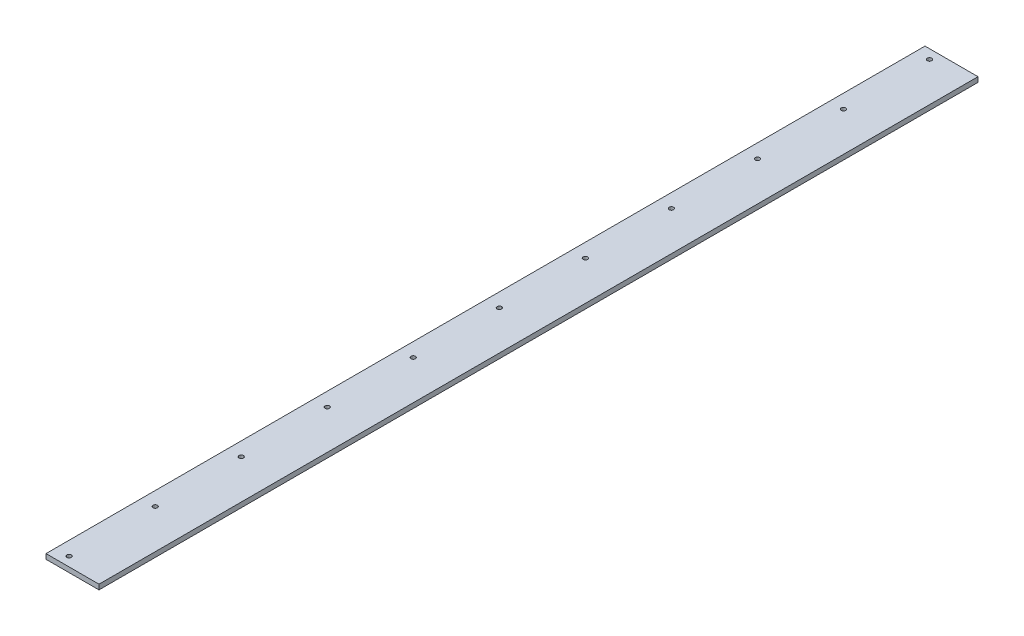
ISO-10303-21;
HEADER;
FILE_DESCRIPTION(('STEP AP214'),'2;1');
FILE_NAME('part.step','',(''),(''),'','','');
FILE_SCHEMA(('AUTOMOTIVE_DESIGN { 1 0 10303 214 1 1 1 1 }'));
ENDSEC;
DATA;
#1=APPLICATION_CONTEXT('core data for automotive mechanical design processes');
#2=APPLICATION_PROTOCOL_DEFINITION('international standard','automotive_design',2000,#1);
#3=PRODUCT_CONTEXT('',#1,'mechanical');
#4=PRODUCT('Part','Part','',(#3));
#5=PRODUCT_RELATED_PRODUCT_CATEGORY('part','',(#4));
#6=PRODUCT_DEFINITION_FORMATION('','',#4);
#7=PRODUCT_DEFINITION_CONTEXT('part definition',#1,'design');
#8=PRODUCT_DEFINITION('design','',#6,#7);
#9=PRODUCT_DEFINITION_SHAPE('','',#8);
#10=(LENGTH_UNIT() NAMED_UNIT(*) SI_UNIT(.MILLI.,.METRE.));
#11=(NAMED_UNIT(*) PLANE_ANGLE_UNIT() SI_UNIT($,.RADIAN.));
#12=(NAMED_UNIT(*) SI_UNIT($,.STERADIAN.) SOLID_ANGLE_UNIT());
#13=UNCERTAINTY_MEASURE_WITH_UNIT(LENGTH_MEASURE(1.E-05),#10,'distance_accuracy_value','');
#14=(GEOMETRIC_REPRESENTATION_CONTEXT(3) GLOBAL_UNCERTAINTY_ASSIGNED_CONTEXT((#13)) GLOBAL_UNIT_ASSIGNED_CONTEXT((#10,
#11,#12)) REPRESENTATION_CONTEXT('',''));
#15=CARTESIAN_POINT('',(0.,0.,0.));
#16=DIRECTION('',(0.,0.,1.));
#17=DIRECTION('',(1.,0.,0.));
#18=AXIS2_PLACEMENT_3D('',#15,#16,#17);
#19=CARTESIAN_POINT('',(-32.1866248836563,0.,795.375640553966));
#20=DIRECTION('',(1.,0.,0.));
#21=DIRECTION('',(0.,0.,-1.));
#22=AXIS2_PLACEMENT_3D('',#19,#20,#21);
#23=PLANE('',#22);
#24=DIRECTION('',(0.,-1.,0.));
#25=VECTOR('',#24,1.);
#26=CARTESIAN_POINT('',(-32.1866248836563,0.,705.));
#27=LINE('',#26,#25);
#28=CARTESIAN_POINT('',(-32.1866248836563,8.,705.));
#29=VERTEX_POINT('',#28);
#30=CARTESIAN_POINT('',(-32.1866248836563,0.,705.));
#31=VERTEX_POINT('',#30);
#32=EDGE_CURVE('E140',#29,#31,#27,.T.);
#33=ORIENTED_EDGE('',*,*,#32,.F.);
#34=DIRECTION('',(0.,0.,-1.));
#35=VECTOR('',#34,1.);
#36=CARTESIAN_POINT('',(-32.1866248836563,8.,795.375640553966));
#37=LINE('',#36,#35);
#38=CARTESIAN_POINT('',(-32.1866248836563,8.,-705.));
#39=VERTEX_POINT('',#38);
#40=EDGE_CURVE('E39',#29,#39,#37,.T.);
#41=ORIENTED_EDGE('',*,*,#40,.T.);
#42=DIRECTION('',(0.,-1.,0.));
#43=VECTOR('',#42,1.);
#44=CARTESIAN_POINT('',(-32.1866248836563,0.,-705.));
#45=LINE('',#44,#43);
#46=CARTESIAN_POINT('',(-32.1866248836563,0.,-705.));
#47=VERTEX_POINT('',#46);
#48=EDGE_CURVE('E94',#39,#47,#45,.T.);
#49=ORIENTED_EDGE('',*,*,#48,.T.);
#50=DIRECTION('',(0.,0.,-1.));
#51=VECTOR('',#50,1.);
#52=CARTESIAN_POINT('',(-32.1866248836563,0.,795.375640553966));
#53=LINE('',#52,#51);
#54=EDGE_CURVE('E82',#31,#47,#53,.T.);
#55=ORIENTED_EDGE('',*,*,#54,.F.);
#56=EDGE_LOOP('',(#33,#41,#49,#55));
#57=FACE_BOUND('',#56,.T.);
#58=ADVANCED_FACE('F35',(#57),#23,.F.);
#59=CARTESIAN_POINT('',(-32.1866248836563,0.,795.375640553966));
#60=DIRECTION('',(0.,1.,0.));
#61=DIRECTION('',(-1.,0.,0.));
#62=AXIS2_PLACEMENT_3D('',#59,#60,#61);
#63=PLANE('',#62);
#64=DIRECTION('',(1.,0.,0.));
#65=VECTOR('',#64,1.);
#66=CARTESIAN_POINT('',(-32.1866248836563,0.,-705.));
#67=LINE('',#66,#65);
#68=CARTESIAN_POINT('',(52.8133751163437,0.,-705.));
#69=VERTEX_POINT('',#68);
#70=EDGE_CURVE('E86',#47,#69,#67,.T.);
#71=ORIENTED_EDGE('',*,*,#70,.T.);
#72=DIRECTION('',(0.,0.,-1.));
#73=VECTOR('',#72,1.);
#74=CARTESIAN_POINT('',(52.8133751163437,0.,795.375640553966));
#75=LINE('',#74,#73);
#76=CARTESIAN_POINT('',(52.8133751163437,0.,705.));
#77=VERTEX_POINT('',#76);
#78=EDGE_CURVE('E88',#77,#69,#75,.T.);
#79=ORIENTED_EDGE('',*,*,#78,.F.);
#80=DIRECTION('',(1.,0.,0.));
#81=VECTOR('',#80,1.);
#82=CARTESIAN_POINT('',(-32.1866248836563,0.,705.));
#83=LINE('',#82,#81);
#84=EDGE_CURVE('E44',#31,#77,#83,.T.);
#85=ORIENTED_EDGE('',*,*,#84,.F.);
#86=ORIENTED_EDGE('',*,*,#54,.T.);
#87=EDGE_LOOP('',(#71,#79,#85,#86));
#88=FACE_BOUND('',#87,.T.);
#89=CARTESIAN_POINT('',(-10.0060966544101,0.,690.));
#90=DIRECTION('',(0.,-1.,0.));
#91=DIRECTION('',(0.,0.,-1.));
#92=AXIS2_PLACEMENT_3D('',#89,#90,#91);
#93=CIRCLE('',#92,3.55);
#94=CARTESIAN_POINT('',(-10.0060966544101,0.,686.45));
#95=VERTEX_POINT('',#94);
#96=EDGE_CURVE('E103',#95,#95,#93,.T.);
#97=ORIENTED_EDGE('',*,*,#96,.F.);
#98=EDGE_LOOP('',(#97));
#99=FACE_BOUND('',#98,.T.);
#100=CARTESIAN_POINT('',(-10.0060966544102,0.,552.));
#101=DIRECTION('',(0.,-1.,0.));
#102=DIRECTION('',(0.,0.,-1.));
#103=AXIS2_PLACEMENT_3D('',#100,#101,#102);
#104=CIRCLE('',#103,3.55);
#105=CARTESIAN_POINT('',(-10.0060966544102,0.,548.45));
#106=VERTEX_POINT('',#105);
#107=EDGE_CURVE('E109',#106,#106,#104,.T.);
#108=ORIENTED_EDGE('',*,*,#107,.F.);
#109=EDGE_LOOP('',(#108));
#110=FACE_BOUND('',#109,.T.);
#111=CARTESIAN_POINT('',(-10.0060966544102,0.,414.));
#112=DIRECTION('',(0.,-1.,0.));
#113=DIRECTION('',(0.,0.,-1.));
#114=AXIS2_PLACEMENT_3D('',#111,#112,#113);
#115=CIRCLE('',#114,3.55);
#116=CARTESIAN_POINT('',(-10.0060966544102,0.,410.45));
#117=VERTEX_POINT('',#116);
#118=EDGE_CURVE('E115',#117,#117,#115,.T.);
#119=ORIENTED_EDGE('',*,*,#118,.F.);
#120=EDGE_LOOP('',(#119));
#121=FACE_BOUND('',#120,.T.);
#122=CARTESIAN_POINT('',(-10.0060966544102,0.,138.));
#123=DIRECTION('',(0.,-1.,0.));
#124=DIRECTION('',(0.,0.,-1.));
#125=AXIS2_PLACEMENT_3D('',#122,#123,#124);
#126=CIRCLE('',#125,3.55);
#127=CARTESIAN_POINT('',(-10.0060966544102,0.,134.45));
#128=VERTEX_POINT('',#127);
#129=EDGE_CURVE('E121',#128,#128,#126,.T.);
#130=ORIENTED_EDGE('',*,*,#129,.F.);
#131=EDGE_LOOP('',(#130));
#132=FACE_BOUND('',#131,.T.);
#133=CARTESIAN_POINT('',(-10.0060966544102,0.,276.));
#134=DIRECTION('',(0.,-1.,0.));
#135=DIRECTION('',(0.,0.,-1.));
#136=AXIS2_PLACEMENT_3D('',#133,#134,#135);
#137=CIRCLE('',#136,3.55);
#138=CARTESIAN_POINT('',(-10.0060966544102,0.,272.45));
#139=VERTEX_POINT('',#138);
#140=EDGE_CURVE('E133',#139,#139,#137,.T.);
#141=ORIENTED_EDGE('',*,*,#140,.F.);
#142=EDGE_LOOP('',(#141));
#143=FACE_BOUND('',#142,.T.);
#144=CARTESIAN_POINT('',(-10.0060966544101,0.,0.));
#145=DIRECTION('',(0.,-1.,0.));
#146=DIRECTION('',(0.,0.,-1.));
#147=AXIS2_PLACEMENT_3D('',#144,#145,#146);
#148=CIRCLE('',#147,3.55);
#149=CARTESIAN_POINT('',(-10.0060966544101,0.,-3.55));
#150=VERTEX_POINT('',#149);
#151=EDGE_CURVE('E127',#150,#150,#148,.T.);
#152=ORIENTED_EDGE('',*,*,#151,.F.);
#153=EDGE_LOOP('',(#152));
#154=FACE_BOUND('',#153,.T.);
#155=CARTESIAN_POINT('',(-10.0060966544101,0.,-690.));
#156=DIRECTION('',(0.,1.,0.));
#157=DIRECTION('',(0.,0.,1.));
#158=AXIS2_PLACEMENT_3D('',#155,#156,#157);
#159=CIRCLE('',#158,3.55);
#160=CARTESIAN_POINT('',(-10.0060966544101,0.,-686.45));
#161=VERTEX_POINT('',#160);
#162=EDGE_CURVE('E189',#161,#161,#159,.T.);
#163=ORIENTED_EDGE('',*,*,#162,.T.);
#164=EDGE_LOOP('',(#163));
#165=FACE_BOUND('',#164,.T.);
#166=CARTESIAN_POINT('',(-10.0060966544102,0.,-552.));
#167=DIRECTION('',(0.,1.,0.));
#168=DIRECTION('',(0.,0.,1.));
#169=AXIS2_PLACEMENT_3D('',#166,#167,#168);
#170=CIRCLE('',#169,3.55);
#171=CARTESIAN_POINT('',(-10.0060966544102,0.,-548.45));
#172=VERTEX_POINT('',#171);
#173=EDGE_CURVE('E185',#172,#172,#170,.T.);
#174=ORIENTED_EDGE('',*,*,#173,.T.);
#175=EDGE_LOOP('',(#174));
#176=FACE_BOUND('',#175,.T.);
#177=CARTESIAN_POINT('',(-10.0060966544102,0.,-414.));
#178=DIRECTION('',(0.,1.,0.));
#179=DIRECTION('',(0.,0.,1.));
#180=AXIS2_PLACEMENT_3D('',#177,#178,#179);
#181=CIRCLE('',#180,3.55);
#182=CARTESIAN_POINT('',(-10.0060966544102,0.,-410.45));
#183=VERTEX_POINT('',#182);
#184=EDGE_CURVE('E181',#183,#183,#181,.T.);
#185=ORIENTED_EDGE('',*,*,#184,.T.);
#186=EDGE_LOOP('',(#185));
#187=FACE_BOUND('',#186,.T.);
#188=CARTESIAN_POINT('',(-10.0060966544102,0.,-138.));
#189=DIRECTION('',(0.,1.,0.));
#190=DIRECTION('',(0.,0.,1.));
#191=AXIS2_PLACEMENT_3D('',#188,#189,#190);
#192=CIRCLE('',#191,3.55);
#193=CARTESIAN_POINT('',(-10.0060966544102,0.,-134.45));
#194=VERTEX_POINT('',#193);
#195=EDGE_CURVE('E177',#194,#194,#192,.T.);
#196=ORIENTED_EDGE('',*,*,#195,.T.);
#197=EDGE_LOOP('',(#196));
#198=FACE_BOUND('',#197,.T.);
#199=CARTESIAN_POINT('',(-10.0060966544102,0.,-276.));
#200=DIRECTION('',(0.,1.,0.));
#201=DIRECTION('',(0.,0.,1.));
#202=AXIS2_PLACEMENT_3D('',#199,#200,#201);
#203=CIRCLE('',#202,3.55);
#204=CARTESIAN_POINT('',(-10.0060966544102,0.,-272.45));
#205=VERTEX_POINT('',#204);
#206=EDGE_CURVE('E171',#205,#205,#203,.T.);
#207=ORIENTED_EDGE('',*,*,#206,.T.);
#208=EDGE_LOOP('',(#207));
#209=FACE_BOUND('',#208,.T.);
#210=ADVANCED_FACE('F84',(#88,#99,#110,#121,#132,#143,#154,#165,#176,#187,#198,#209),#63,.F.);
#211=CARTESIAN_POINT('',(52.8133751163437,0.,795.375640553966));
#212=DIRECTION('',(-1.,0.,0.));
#213=DIRECTION('',(0.,0.,1.));
#214=AXIS2_PLACEMENT_3D('',#211,#212,#213);
#215=PLANE('',#214);
#216=DIRECTION('',(0.,1.,0.));
#217=VECTOR('',#216,1.);
#218=CARTESIAN_POINT('',(52.8133751163437,0.,705.));
#219=LINE('',#218,#217);
#220=CARTESIAN_POINT('',(52.8133751163437,8.,705.));
#221=VERTEX_POINT('',#220);
#222=EDGE_CURVE('E11',#77,#221,#219,.T.);
#223=ORIENTED_EDGE('',*,*,#222,.F.);
#224=ORIENTED_EDGE('',*,*,#78,.T.);
#225=DIRECTION('',(0.,1.,0.));
#226=VECTOR('',#225,1.);
#227=CARTESIAN_POINT('',(52.8133751163437,0.,-705.));
#228=LINE('',#227,#226);
#229=CARTESIAN_POINT('',(52.8133751163437,8.,-705.));
#230=VERTEX_POINT('',#229);
#231=EDGE_CURVE('E95',#69,#230,#228,.T.);
#232=ORIENTED_EDGE('',*,*,#231,.T.);
#233=DIRECTION('',(0.,0.,-1.));
#234=VECTOR('',#233,1.);
#235=CARTESIAN_POINT('',(52.8133751163437,8.,795.375640553966));
#236=LINE('',#235,#234);
#237=EDGE_CURVE('E60',#221,#230,#236,.T.);
#238=ORIENTED_EDGE('',*,*,#237,.F.);
#239=EDGE_LOOP('',(#223,#224,#232,#238));
#240=FACE_BOUND('',#239,.T.);
#241=ADVANCED_FACE('F145',(#240),#215,.F.);
#242=CARTESIAN_POINT('',(-32.1866248836563,8.,795.375640553966));
#243=DIRECTION('',(0.,-1.,0.));
#244=DIRECTION('',(0.,0.,-1.));
#245=AXIS2_PLACEMENT_3D('',#242,#243,#244);
#246=PLANE('',#245);
#247=CARTESIAN_POINT('',(-10.0060966544101,8.,0.));
#248=DIRECTION('',(0.,-1.,0.));
#249=DIRECTION('',(0.,0.,-1.));
#250=AXIS2_PLACEMENT_3D('',#247,#248,#249);
#251=CIRCLE('',#250,3.55);
#252=CARTESIAN_POINT('',(-10.0060966544101,8.,-3.55));
#253=VERTEX_POINT('',#252);
#254=EDGE_CURVE('E130',#253,#253,#251,.T.);
#255=ORIENTED_EDGE('',*,*,#254,.T.);
#256=EDGE_LOOP('',(#255));
#257=FACE_BOUND('',#256,.T.);
#258=CARTESIAN_POINT('',(-10.0060966544101,8.,690.));
#259=DIRECTION('',(0.,-1.,0.));
#260=DIRECTION('',(0.,0.,-1.));
#261=AXIS2_PLACEMENT_3D('',#258,#259,#260);
#262=CIRCLE('',#261,3.55);
#263=CARTESIAN_POINT('',(-10.0060966544101,8.,686.45));
#264=VERTEX_POINT('',#263);
#265=EDGE_CURVE('E106',#264,#264,#262,.T.);
#266=ORIENTED_EDGE('',*,*,#265,.T.);
#267=EDGE_LOOP('',(#266));
#268=FACE_BOUND('',#267,.T.);
#269=CARTESIAN_POINT('',(-10.0060966544102,8.,552.));
#270=DIRECTION('',(0.,-1.,0.));
#271=DIRECTION('',(0.,0.,-1.));
#272=AXIS2_PLACEMENT_3D('',#269,#270,#271);
#273=CIRCLE('',#272,3.55);
#274=CARTESIAN_POINT('',(-10.0060966544102,8.,548.45));
#275=VERTEX_POINT('',#274);
#276=EDGE_CURVE('E112',#275,#275,#273,.T.);
#277=ORIENTED_EDGE('',*,*,#276,.T.);
#278=EDGE_LOOP('',(#277));
#279=FACE_BOUND('',#278,.T.);
#280=CARTESIAN_POINT('',(-10.0060966544102,8.,414.));
#281=DIRECTION('',(0.,-1.,0.));
#282=DIRECTION('',(0.,0.,-1.));
#283=AXIS2_PLACEMENT_3D('',#280,#281,#282);
#284=CIRCLE('',#283,3.55);
#285=CARTESIAN_POINT('',(-10.0060966544102,8.,410.45));
#286=VERTEX_POINT('',#285);
#287=EDGE_CURVE('E118',#286,#286,#284,.T.);
#288=ORIENTED_EDGE('',*,*,#287,.T.);
#289=EDGE_LOOP('',(#288));
#290=FACE_BOUND('',#289,.T.);
#291=CARTESIAN_POINT('',(-10.0060966544102,8.,138.));
#292=DIRECTION('',(0.,-1.,0.));
#293=DIRECTION('',(0.,0.,-1.));
#294=AXIS2_PLACEMENT_3D('',#291,#292,#293);
#295=CIRCLE('',#294,3.55);
#296=CARTESIAN_POINT('',(-10.0060966544102,8.,134.45));
#297=VERTEX_POINT('',#296);
#298=EDGE_CURVE('E124',#297,#297,#295,.T.);
#299=ORIENTED_EDGE('',*,*,#298,.T.);
#300=EDGE_LOOP('',(#299));
#301=FACE_BOUND('',#300,.T.);
#302=CARTESIAN_POINT('',(-10.0060966544102,8.,276.));
#303=DIRECTION('',(0.,-1.,0.));
#304=DIRECTION('',(0.,0.,-1.));
#305=AXIS2_PLACEMENT_3D('',#302,#303,#304);
#306=CIRCLE('',#305,3.55);
#307=CARTESIAN_POINT('',(-10.0060966544102,8.,272.45));
#308=VERTEX_POINT('',#307);
#309=EDGE_CURVE('E136',#308,#308,#306,.T.);
#310=ORIENTED_EDGE('',*,*,#309,.T.);
#311=EDGE_LOOP('',(#310));
#312=FACE_BOUND('',#311,.T.);
#313=ORIENTED_EDGE('',*,*,#237,.T.);
#314=DIRECTION('',(-1.,0.,0.));
#315=VECTOR('',#314,1.);
#316=CARTESIAN_POINT('',(-32.1866248836563,8.,-705.));
#317=LINE('',#316,#315);
#318=EDGE_CURVE('E97',#230,#39,#317,.T.);
#319=ORIENTED_EDGE('',*,*,#318,.T.);
#320=ORIENTED_EDGE('',*,*,#40,.F.);
#321=DIRECTION('',(-1.,0.,0.));
#322=VECTOR('',#321,1.);
#323=CARTESIAN_POINT('',(-32.1866248836563,8.,705.));
#324=LINE('',#323,#322);
#325=EDGE_CURVE('E142',#221,#29,#324,.T.);
#326=ORIENTED_EDGE('',*,*,#325,.F.);
#327=EDGE_LOOP('',(#313,#319,#320,#326));
#328=FACE_BOUND('',#327,.T.);
#329=CARTESIAN_POINT('',(-10.0060966544101,8.,-690.));
#330=DIRECTION('',(0.,1.,0.));
#331=DIRECTION('',(0.,0.,1.));
#332=AXIS2_PLACEMENT_3D('',#329,#330,#331);
#333=CIRCLE('',#332,3.55);
#334=CARTESIAN_POINT('',(-10.0060966544101,8.,-686.45));
#335=VERTEX_POINT('',#334);
#336=EDGE_CURVE('E155',#335,#335,#333,.T.);
#337=ORIENTED_EDGE('',*,*,#336,.F.);
#338=EDGE_LOOP('',(#337));
#339=FACE_BOUND('',#338,.T.);
#340=CARTESIAN_POINT('',(-10.0060966544102,8.,-552.));
#341=DIRECTION('',(0.,1.,0.));
#342=DIRECTION('',(0.,0.,1.));
#343=AXIS2_PLACEMENT_3D('',#340,#341,#342);
#344=CIRCLE('',#343,3.55);
#345=CARTESIAN_POINT('',(-10.0060966544102,8.,-548.45));
#346=VERTEX_POINT('',#345);
#347=EDGE_CURVE('E159',#346,#346,#344,.T.);
#348=ORIENTED_EDGE('',*,*,#347,.F.);
#349=EDGE_LOOP('',(#348));
#350=FACE_BOUND('',#349,.T.);
#351=CARTESIAN_POINT('',(-10.0060966544102,8.,-414.));
#352=DIRECTION('',(0.,1.,0.));
#353=DIRECTION('',(0.,0.,1.));
#354=AXIS2_PLACEMENT_3D('',#351,#352,#353);
#355=CIRCLE('',#354,3.55);
#356=CARTESIAN_POINT('',(-10.0060966544102,8.,-410.45));
#357=VERTEX_POINT('',#356);
#358=EDGE_CURVE('E163',#357,#357,#355,.T.);
#359=ORIENTED_EDGE('',*,*,#358,.F.);
#360=EDGE_LOOP('',(#359));
#361=FACE_BOUND('',#360,.T.);
#362=CARTESIAN_POINT('',(-10.0060966544102,8.,-138.));
#363=DIRECTION('',(0.,1.,0.));
#364=DIRECTION('',(0.,0.,1.));
#365=AXIS2_PLACEMENT_3D('',#362,#363,#364);
#366=CIRCLE('',#365,3.55);
#367=CARTESIAN_POINT('',(-10.0060966544102,8.,-134.45));
#368=VERTEX_POINT('',#367);
#369=EDGE_CURVE('E167',#368,#368,#366,.T.);
#370=ORIENTED_EDGE('',*,*,#369,.F.);
#371=EDGE_LOOP('',(#370));
#372=FACE_BOUND('',#371,.T.);
#373=CARTESIAN_POINT('',(-10.0060966544102,8.,-276.));
#374=DIRECTION('',(0.,1.,0.));
#375=DIRECTION('',(0.,0.,1.));
#376=AXIS2_PLACEMENT_3D('',#373,#374,#375);
#377=CIRCLE('',#376,3.55);
#378=CARTESIAN_POINT('',(-10.0060966544102,8.,-272.45));
#379=VERTEX_POINT('',#378);
#380=EDGE_CURVE('E99',#379,#379,#377,.T.);
#381=ORIENTED_EDGE('',*,*,#380,.F.);
#382=EDGE_LOOP('',(#381));
#383=FACE_BOUND('',#382,.T.);
#384=ADVANCED_FACE('F147',(#257,#268,#279,#290,#301,#312,#328,#339,#350,#361,#372,#383),#246,.F.);
#385=CARTESIAN_POINT('',(8.53553390593265,-8.53553390593278,705.));
#386=DIRECTION('',(0.,0.,1.));
#387=DIRECTION('',(0.309016994374945,0.951056516295155,0.));
#388=AXIS2_PLACEMENT_3D('',#385,#386,#387);
#389=PLANE('',#388);
#390=ORIENTED_EDGE('',*,*,#325,.T.);
#391=ORIENTED_EDGE('',*,*,#32,.T.);
#392=ORIENTED_EDGE('',*,*,#84,.T.);
#393=ORIENTED_EDGE('',*,*,#222,.T.);
#394=EDGE_LOOP('',(#390,#391,#392,#393));
#395=FACE_BOUND('',#394,.T.);
#396=ADVANCED_FACE('F37',(#395),#389,.T.);
#397=CARTESIAN_POINT('',(-10.0060966544102,0.,276.));
#398=DIRECTION('',(0.,-1.,0.));
#399=DIRECTION('',(0.,0.,-1.));
#400=AXIS2_PLACEMENT_3D('',#397,#398,#399);
#401=CYLINDRICAL_SURFACE('',#400,3.55);
#402=ORIENTED_EDGE('',*,*,#309,.F.);
#403=EDGE_LOOP('',(#402));
#404=FACE_BOUND('',#403,.T.);
#405=ORIENTED_EDGE('',*,*,#140,.T.);
#406=EDGE_LOOP('',(#405));
#407=FACE_BOUND('',#406,.T.);
#408=ADVANCED_FACE('F214',(#404,#407),#401,.F.);
#409=CARTESIAN_POINT('',(-10.0060966544101,0.,0.));
#410=DIRECTION('',(0.,-1.,0.));
#411=DIRECTION('',(0.,0.,-1.));
#412=AXIS2_PLACEMENT_3D('',#409,#410,#411);
#413=CYLINDRICAL_SURFACE('',#412,3.55);
#414=ORIENTED_EDGE('',*,*,#151,.T.);
#415=EDGE_LOOP('',(#414));
#416=FACE_BOUND('',#415,.T.);
#417=ORIENTED_EDGE('',*,*,#254,.F.);
#418=EDGE_LOOP('',(#417));
#419=FACE_BOUND('',#418,.T.);
#420=ADVANCED_FACE('F217',(#416,#419),#413,.F.);
#421=CARTESIAN_POINT('',(-10.0060966544102,0.,138.));
#422=DIRECTION('',(0.,-1.,0.));
#423=DIRECTION('',(0.,0.,-1.));
#424=AXIS2_PLACEMENT_3D('',#421,#422,#423);
#425=CYLINDRICAL_SURFACE('',#424,3.55);
#426=ORIENTED_EDGE('',*,*,#298,.F.);
#427=EDGE_LOOP('',(#426));
#428=FACE_BOUND('',#427,.T.);
#429=ORIENTED_EDGE('',*,*,#129,.T.);
#430=EDGE_LOOP('',(#429));
#431=FACE_BOUND('',#430,.T.);
#432=ADVANCED_FACE('F221',(#428,#431),#425,.F.);
#433=CARTESIAN_POINT('',(-10.0060966544102,0.,414.));
#434=DIRECTION('',(0.,-1.,0.));
#435=DIRECTION('',(0.,0.,-1.));
#436=AXIS2_PLACEMENT_3D('',#433,#434,#435);
#437=CYLINDRICAL_SURFACE('',#436,3.55);
#438=ORIENTED_EDGE('',*,*,#287,.F.);
#439=EDGE_LOOP('',(#438));
#440=FACE_BOUND('',#439,.T.);
#441=ORIENTED_EDGE('',*,*,#118,.T.);
#442=EDGE_LOOP('',(#441));
#443=FACE_BOUND('',#442,.T.);
#444=ADVANCED_FACE('F225',(#440,#443),#437,.F.);
#445=CARTESIAN_POINT('',(-10.0060966544102,0.,552.));
#446=DIRECTION('',(0.,-1.,0.));
#447=DIRECTION('',(0.,0.,-1.));
#448=AXIS2_PLACEMENT_3D('',#445,#446,#447);
#449=CYLINDRICAL_SURFACE('',#448,3.55);
#450=ORIENTED_EDGE('',*,*,#276,.F.);
#451=EDGE_LOOP('',(#450));
#452=FACE_BOUND('',#451,.T.);
#453=ORIENTED_EDGE('',*,*,#107,.T.);
#454=EDGE_LOOP('',(#453));
#455=FACE_BOUND('',#454,.T.);
#456=ADVANCED_FACE('F229',(#452,#455),#449,.F.);
#457=CARTESIAN_POINT('',(-10.0060966544101,0.,690.));
#458=DIRECTION('',(0.,-1.,0.));
#459=DIRECTION('',(0.,0.,-1.));
#460=AXIS2_PLACEMENT_3D('',#457,#458,#459);
#461=CYLINDRICAL_SURFACE('',#460,3.55);
#462=ORIENTED_EDGE('',*,*,#265,.F.);
#463=EDGE_LOOP('',(#462));
#464=FACE_BOUND('',#463,.T.);
#465=ORIENTED_EDGE('',*,*,#96,.T.);
#466=EDGE_LOOP('',(#465));
#467=FACE_BOUND('',#466,.T.);
#468=ADVANCED_FACE('F233',(#464,#467),#461,.F.);
#469=CARTESIAN_POINT('',(8.53553390593265,-8.53553390593278,-705.));
#470=DIRECTION('',(0.,0.,-1.));
#471=DIRECTION('',(0.309016994374945,0.951056516295155,0.));
#472=AXIS2_PLACEMENT_3D('',#469,#470,#471);
#473=PLANE('',#472);
#474=ORIENTED_EDGE('',*,*,#318,.F.);
#475=ORIENTED_EDGE('',*,*,#231,.F.);
#476=ORIENTED_EDGE('',*,*,#70,.F.);
#477=ORIENTED_EDGE('',*,*,#48,.F.);
#478=EDGE_LOOP('',(#474,#475,#476,#477));
#479=FACE_BOUND('',#478,.T.);
#480=ADVANCED_FACE('F93',(#479),#473,.T.);
#481=CARTESIAN_POINT('',(-10.0060966544102,0.,-276.));
#482=DIRECTION('',(0.,-1.,0.));
#483=DIRECTION('',(0.,0.,1.));
#484=AXIS2_PLACEMENT_3D('',#481,#482,#483);
#485=CYLINDRICAL_SURFACE('',#484,3.55);
#486=ORIENTED_EDGE('',*,*,#380,.T.);
#487=EDGE_LOOP('',(#486));
#488=FACE_BOUND('',#487,.T.);
#489=ORIENTED_EDGE('',*,*,#206,.F.);
#490=EDGE_LOOP('',(#489));
#491=FACE_BOUND('',#490,.T.);
#492=ADVANCED_FACE('F240',(#488,#491),#485,.F.);
#493=CARTESIAN_POINT('',(-10.0060966544102,0.,-138.));
#494=DIRECTION('',(0.,-1.,0.));
#495=DIRECTION('',(0.,0.,1.));
#496=AXIS2_PLACEMENT_3D('',#493,#494,#495);
#497=CYLINDRICAL_SURFACE('',#496,3.55);
#498=ORIENTED_EDGE('',*,*,#369,.T.);
#499=EDGE_LOOP('',(#498));
#500=FACE_BOUND('',#499,.T.);
#501=ORIENTED_EDGE('',*,*,#195,.F.);
#502=EDGE_LOOP('',(#501));
#503=FACE_BOUND('',#502,.T.);
#504=ADVANCED_FACE('F243',(#500,#503),#497,.F.);
#505=CARTESIAN_POINT('',(-10.0060966544102,0.,-414.));
#506=DIRECTION('',(0.,-1.,0.));
#507=DIRECTION('',(0.,0.,1.));
#508=AXIS2_PLACEMENT_3D('',#505,#506,#507);
#509=CYLINDRICAL_SURFACE('',#508,3.55);
#510=ORIENTED_EDGE('',*,*,#358,.T.);
#511=EDGE_LOOP('',(#510));
#512=FACE_BOUND('',#511,.T.);
#513=ORIENTED_EDGE('',*,*,#184,.F.);
#514=EDGE_LOOP('',(#513));
#515=FACE_BOUND('',#514,.T.);
#516=ADVANCED_FACE('F203',(#512,#515),#509,.F.);
#517=CARTESIAN_POINT('',(-10.0060966544102,0.,-552.));
#518=DIRECTION('',(0.,-1.,0.));
#519=DIRECTION('',(0.,0.,1.));
#520=AXIS2_PLACEMENT_3D('',#517,#518,#519);
#521=CYLINDRICAL_SURFACE('',#520,3.55);
#522=ORIENTED_EDGE('',*,*,#347,.T.);
#523=EDGE_LOOP('',(#522));
#524=FACE_BOUND('',#523,.T.);
#525=ORIENTED_EDGE('',*,*,#173,.F.);
#526=EDGE_LOOP('',(#525));
#527=FACE_BOUND('',#526,.T.);
#528=ADVANCED_FACE('F197',(#524,#527),#521,.F.);
#529=CARTESIAN_POINT('',(-10.0060966544101,0.,-690.));
#530=DIRECTION('',(0.,-1.,0.));
#531=DIRECTION('',(0.,0.,1.));
#532=AXIS2_PLACEMENT_3D('',#529,#530,#531);
#533=CYLINDRICAL_SURFACE('',#532,3.55);
#534=ORIENTED_EDGE('',*,*,#336,.T.);
#535=EDGE_LOOP('',(#534));
#536=FACE_BOUND('',#535,.T.);
#537=ORIENTED_EDGE('',*,*,#162,.F.);
#538=EDGE_LOOP('',(#537));
#539=FACE_BOUND('',#538,.T.);
#540=ADVANCED_FACE('F195',(#536,#539),#533,.F.);
#541=CLOSED_SHELL('',(#58,#210,#241,#384,#396,#408,#420,#432,#444,#456,#468,#480,#492,#504,#516,
#528,#540));
#542=MANIFOLD_SOLID_BREP('B2',#541);
#543=ADVANCED_BREP_SHAPE_REPRESENTATION('',(#18,#542),#14);
#544=SHAPE_DEFINITION_REPRESENTATION(#9,#543);
ENDSEC;
END-ISO-10303-21;
